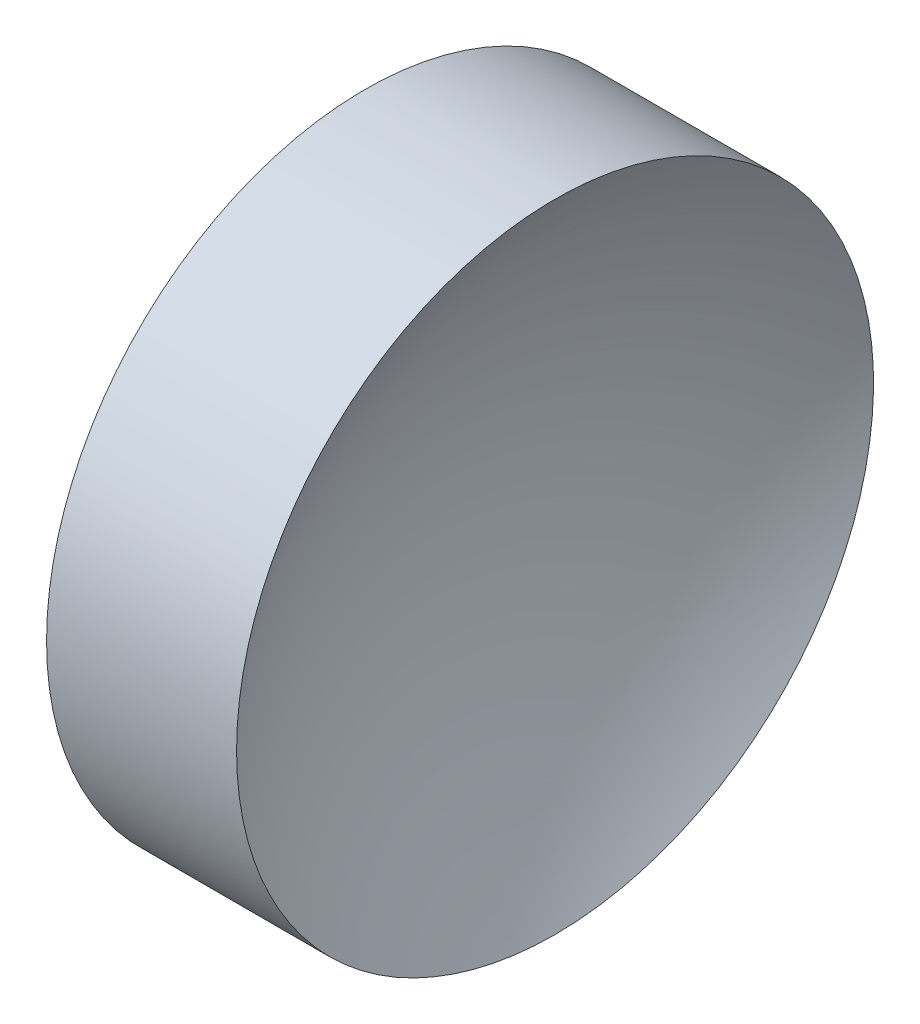
ISO-10303-21;
HEADER;
FILE_DESCRIPTION(('STEP AP214'),'2;1');
FILE_NAME('part.step','',(''),(''),'','','');
FILE_SCHEMA(('AUTOMOTIVE_DESIGN { 1 0 10303 214 1 1 1 1 }'));
ENDSEC;
DATA;
#1=APPLICATION_CONTEXT('core data for automotive mechanical design processes');
#2=APPLICATION_PROTOCOL_DEFINITION('international standard','automotive_design',2000,#1);
#3=PRODUCT_CONTEXT('',#1,'mechanical');
#4=PRODUCT('Part','Part','',(#3));
#5=PRODUCT_RELATED_PRODUCT_CATEGORY('part','',(#4));
#6=PRODUCT_DEFINITION_FORMATION('','',#4);
#7=PRODUCT_DEFINITION_CONTEXT('part definition',#1,'design');
#8=PRODUCT_DEFINITION('design','',#6,#7);
#9=PRODUCT_DEFINITION_SHAPE('','',#8);
#10=(LENGTH_UNIT() NAMED_UNIT(*) SI_UNIT(.MILLI.,.METRE.));
#11=(NAMED_UNIT(*) PLANE_ANGLE_UNIT() SI_UNIT($,.RADIAN.));
#12=(NAMED_UNIT(*) SI_UNIT($,.STERADIAN.) SOLID_ANGLE_UNIT());
#13=UNCERTAINTY_MEASURE_WITH_UNIT(LENGTH_MEASURE(1.E-05),#10,'distance_accuracy_value','');
#14=(GEOMETRIC_REPRESENTATION_CONTEXT(3) GLOBAL_UNCERTAINTY_ASSIGNED_CONTEXT((#13)) GLOBAL_UNIT_ASSIGNED_CONTEXT((#10,
#11,#12)) REPRESENTATION_CONTEXT('',''));
#15=CARTESIAN_POINT('',(0.,0.,0.));
#16=DIRECTION('',(0.,0.,1.));
#17=DIRECTION('',(1.,0.,0.));
#18=AXIS2_PLACEMENT_3D('',#15,#16,#17);
#19=CARTESIAN_POINT('',(52.0358273254976,26.0622521828061,0.));
#20=DIRECTION('',(-1.,0.,0.));
#21=DIRECTION('',(0.,-1.,0.));
#22=AXIS2_PLACEMENT_3D('',#19,#20,#21);
#23=SPHERICAL_SURFACE('',#22,9.17);
#24=CARTESIAN_POINT('',(44.3488968587898,26.0622521828061,0.));
#25=DIRECTION('',(-1.,0.,0.));
#26=DIRECTION('',(0.,0.,1.));
#27=AXIS2_PLACEMENT_3D('',#24,#25,#26);
#28=CIRCLE('',#27,4.99999999999999);
#29=CARTESIAN_POINT('',(44.3488968587898,26.0622521828061,4.99999999999999));
#30=VERTEX_POINT('',#29);
#31=EDGE_CURVE('E10',#30,#30,#28,.T.);
#32=ORIENTED_EDGE('',*,*,#31,.F.);
#33=EDGE_LOOP('',(#32));
#34=FACE_BOUND('',#33,.T.);
#35=ADVANCED_FACE('F35',(#34),#23,.F.);
#36=CARTESIAN_POINT('',(39.7365000133641,26.0622521828061,0.));
#37=DIRECTION('',(-1.,0.,0.));
#38=DIRECTION('',(0.,0.,1.));
#39=AXIS2_PLACEMENT_3D('',#36,#37,#38);
#40=CYLINDRICAL_SURFACE('',#39,5.);
#41=CARTESIAN_POINT('',(41.3658273254976,26.0622521828061,0.));
#42=DIRECTION('',(-1.,0.,0.));
#43=DIRECTION('',(0.,0.,1.));
#44=AXIS2_PLACEMENT_3D('',#41,#42,#43);
#45=CIRCLE('',#44,5.);
#46=CARTESIAN_POINT('',(41.3658273254976,26.0622521828061,5.));
#47=VERTEX_POINT('',#46);
#48=EDGE_CURVE('E41',#47,#47,#45,.T.);
#49=ORIENTED_EDGE('',*,*,#48,.F.);
#50=EDGE_LOOP('',(#49));
#51=FACE_BOUND('',#50,.T.);
#52=ORIENTED_EDGE('',*,*,#31,.T.);
#53=EDGE_LOOP('',(#52));
#54=FACE_BOUND('',#53,.T.);
#55=ADVANCED_FACE('F49',(#51,#54),#40,.T.);
#56=CARTESIAN_POINT('',(41.3658273254976,26.0622521828061,0.));
#57=DIRECTION('',(1.,0.,0.));
#58=DIRECTION('',(0.,0.,-1.));
#59=AXIS2_PLACEMENT_3D('',#56,#57,#58);
#60=PLANE('',#59);
#61=ORIENTED_EDGE('',*,*,#48,.T.);
#62=EDGE_LOOP('',(#61));
#63=FACE_BOUND('',#62,.T.);
#64=ADVANCED_FACE('F47',(#63),#60,.F.);
#65=CLOSED_SHELL('',(#35,#55,#64));
#66=MANIFOLD_SOLID_BREP('B2',#65);
#67=ADVANCED_BREP_SHAPE_REPRESENTATION('',(#18,#66),#14);
#68=SHAPE_DEFINITION_REPRESENTATION(#9,#67);
ENDSEC;
END-ISO-10303-21;
